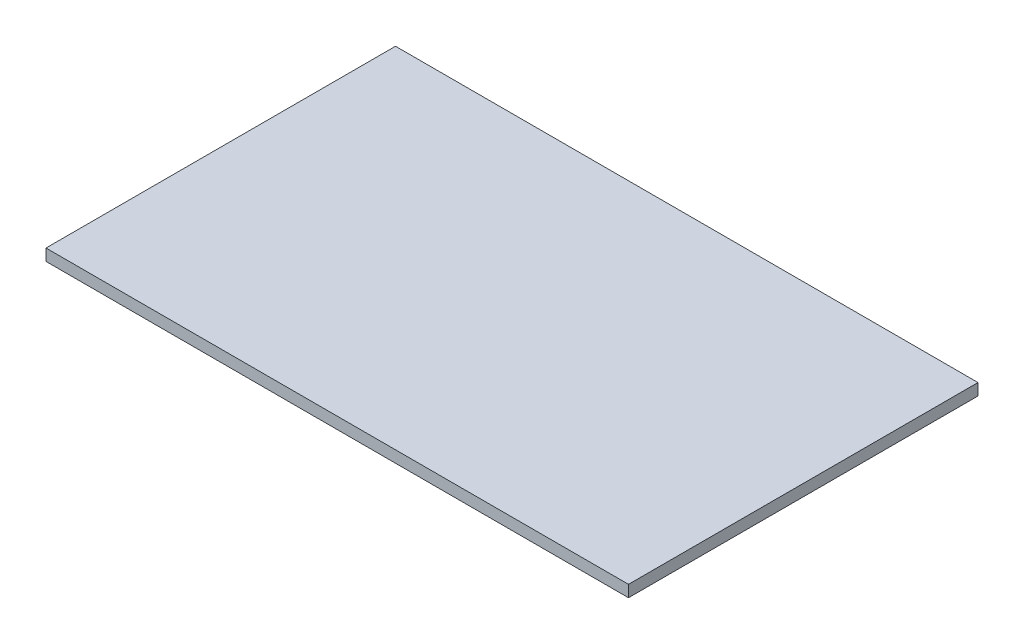
ISO-10303-21;
HEADER;
FILE_DESCRIPTION(('STEP AP214'),'2;1');
FILE_NAME('part.step','',(''),(''),'','','');
FILE_SCHEMA(('AUTOMOTIVE_DESIGN { 1 0 10303 214 1 1 1 1 }'));
ENDSEC;
DATA;
#1=APPLICATION_CONTEXT('core data for automotive mechanical design processes');
#2=APPLICATION_PROTOCOL_DEFINITION('international standard','automotive_design',2000,#1);
#3=PRODUCT_CONTEXT('',#1,'mechanical');
#4=PRODUCT('Part','Part','',(#3));
#5=PRODUCT_RELATED_PRODUCT_CATEGORY('part','',(#4));
#6=PRODUCT_DEFINITION_FORMATION('','',#4);
#7=PRODUCT_DEFINITION_CONTEXT('part definition',#1,'design');
#8=PRODUCT_DEFINITION('design','',#6,#7);
#9=PRODUCT_DEFINITION_SHAPE('','',#8);
#10=(LENGTH_UNIT() NAMED_UNIT(*) SI_UNIT(.MILLI.,.METRE.));
#11=(NAMED_UNIT(*) PLANE_ANGLE_UNIT() SI_UNIT($,.RADIAN.));
#12=(NAMED_UNIT(*) SI_UNIT($,.STERADIAN.) SOLID_ANGLE_UNIT());
#13=UNCERTAINTY_MEASURE_WITH_UNIT(LENGTH_MEASURE(1.E-05),#10,'distance_accuracy_value','');
#14=(GEOMETRIC_REPRESENTATION_CONTEXT(3) GLOBAL_UNCERTAINTY_ASSIGNED_CONTEXT((#13)) GLOBAL_UNIT_ASSIGNED_CONTEXT((#10,
#11,#12)) REPRESENTATION_CONTEXT('',''));
#15=CARTESIAN_POINT('',(0.,0.,0.));
#16=DIRECTION('',(0.,0.,1.));
#17=DIRECTION('',(1.,0.,0.));
#18=AXIS2_PLACEMENT_3D('',#15,#16,#17);
#19=CARTESIAN_POINT('',(0.,5.,0.));
#20=DIRECTION('',(1.,0.,0.));
#21=DIRECTION('',(0.,0.,-1.));
#22=AXIS2_PLACEMENT_3D('',#19,#20,#21);
#23=PLANE('',#22);
#24=DIRECTION('',(0.,0.,1.));
#25=VECTOR('',#24,1.);
#26=CARTESIAN_POINT('',(0.,0.,0.));
#27=LINE('',#26,#25);
#28=CARTESIAN_POINT('',(0.,0.,-150.));
#29=VERTEX_POINT('',#28);
#30=CARTESIAN_POINT('',(0.,0.,0.));
#31=VERTEX_POINT('',#30);
#32=EDGE_CURVE('E95',#29,#31,#27,.T.);
#33=ORIENTED_EDGE('',*,*,#32,.T.);
#34=DIRECTION('',(0.,-1.,0.));
#35=VECTOR('',#34,1.);
#36=CARTESIAN_POINT('',(0.,5.,0.));
#37=LINE('',#36,#35);
#38=CARTESIAN_POINT('',(0.,5.,0.));
#39=VERTEX_POINT('',#38);
#40=EDGE_CURVE('E11',#39,#31,#37,.T.);
#41=ORIENTED_EDGE('',*,*,#40,.F.);
#42=DIRECTION('',(0.,0.,1.));
#43=VECTOR('',#42,1.);
#44=CARTESIAN_POINT('',(0.,5.,0.));
#45=LINE('',#44,#43);
#46=CARTESIAN_POINT('',(0.,5.,-150.));
#47=VERTEX_POINT('',#46);
#48=EDGE_CURVE('E83',#47,#39,#45,.T.);
#49=ORIENTED_EDGE('',*,*,#48,.F.);
#50=DIRECTION('',(0.,-1.,0.));
#51=VECTOR('',#50,1.);
#52=CARTESIAN_POINT('',(0.,5.,-150.));
#53=LINE('',#52,#51);
#54=EDGE_CURVE('E91',#47,#29,#53,.T.);
#55=ORIENTED_EDGE('',*,*,#54,.T.);
#56=EDGE_LOOP('',(#33,#41,#49,#55));
#57=FACE_BOUND('',#56,.T.);
#58=ADVANCED_FACE('F32',(#57),#23,.F.);
#59=CARTESIAN_POINT('',(0.,5.,0.));
#60=DIRECTION('',(0.,0.,-1.));
#61=DIRECTION('',(-1.,0.,0.));
#62=AXIS2_PLACEMENT_3D('',#59,#60,#61);
#63=PLANE('',#62);
#64=DIRECTION('',(1.,0.,0.));
#65=VECTOR('',#64,1.);
#66=CARTESIAN_POINT('',(0.,0.,0.));
#67=LINE('',#66,#65);
#68=CARTESIAN_POINT('',(250.,0.,0.));
#69=VERTEX_POINT('',#68);
#70=EDGE_CURVE('E87',#31,#69,#67,.T.);
#71=ORIENTED_EDGE('',*,*,#70,.T.);
#72=DIRECTION('',(0.,-1.,0.));
#73=VECTOR('',#72,1.);
#74=CARTESIAN_POINT('',(250.,5.,0.));
#75=LINE('',#74,#73);
#76=CARTESIAN_POINT('',(250.,5.,0.));
#77=VERTEX_POINT('',#76);
#78=EDGE_CURVE('E40',#77,#69,#75,.T.);
#79=ORIENTED_EDGE('',*,*,#78,.F.);
#80=DIRECTION('',(1.,0.,0.));
#81=VECTOR('',#80,1.);
#82=CARTESIAN_POINT('',(0.,5.,0.));
#83=LINE('',#82,#81);
#84=EDGE_CURVE('E78',#39,#77,#83,.T.);
#85=ORIENTED_EDGE('',*,*,#84,.F.);
#86=ORIENTED_EDGE('',*,*,#40,.T.);
#87=EDGE_LOOP('',(#71,#79,#85,#86));
#88=FACE_BOUND('',#87,.T.);
#89=ADVANCED_FACE('F86',(#88),#63,.F.);
#90=CARTESIAN_POINT('',(250.,5.,0.));
#91=DIRECTION('',(-1.,0.,0.));
#92=DIRECTION('',(0.,0.,1.));
#93=AXIS2_PLACEMENT_3D('',#90,#91,#92);
#94=PLANE('',#93);
#95=DIRECTION('',(0.,0.,-1.));
#96=VECTOR('',#95,1.);
#97=CARTESIAN_POINT('',(250.,0.,0.));
#98=LINE('',#97,#96);
#99=CARTESIAN_POINT('',(250.,0.,-150.));
#100=VERTEX_POINT('',#99);
#101=EDGE_CURVE('E65',#69,#100,#98,.T.);
#102=ORIENTED_EDGE('',*,*,#101,.T.);
#103=DIRECTION('',(0.,-1.,0.));
#104=VECTOR('',#103,1.);
#105=CARTESIAN_POINT('',(250.,5.,-150.));
#106=LINE('',#105,#104);
#107=CARTESIAN_POINT('',(250.,5.,-150.));
#108=VERTEX_POINT('',#107);
#109=EDGE_CURVE('E88',#108,#100,#106,.T.);
#110=ORIENTED_EDGE('',*,*,#109,.F.);
#111=DIRECTION('',(0.,0.,-1.));
#112=VECTOR('',#111,1.);
#113=CARTESIAN_POINT('',(250.,5.,0.));
#114=LINE('',#113,#112);
#115=EDGE_CURVE('E81',#77,#108,#114,.T.);
#116=ORIENTED_EDGE('',*,*,#115,.F.);
#117=ORIENTED_EDGE('',*,*,#78,.T.);
#118=EDGE_LOOP('',(#102,#110,#116,#117));
#119=FACE_BOUND('',#118,.T.);
#120=ADVANCED_FACE('F89',(#119),#94,.F.);
#121=CARTESIAN_POINT('',(0.,5.,-150.));
#122=DIRECTION('',(0.,0.,1.));
#123=DIRECTION('',(1.,0.,0.));
#124=AXIS2_PLACEMENT_3D('',#121,#122,#123);
#125=PLANE('',#124);
#126=DIRECTION('',(-1.,0.,0.));
#127=VECTOR('',#126,1.);
#128=CARTESIAN_POINT('',(0.,0.,-150.));
#129=LINE('',#128,#127);
#130=EDGE_CURVE('E71',#100,#29,#129,.T.);
#131=ORIENTED_EDGE('',*,*,#130,.T.);
#132=ORIENTED_EDGE('',*,*,#54,.F.);
#133=DIRECTION('',(-1.,0.,0.));
#134=VECTOR('',#133,1.);
#135=CARTESIAN_POINT('',(0.,5.,-150.));
#136=LINE('',#135,#134);
#137=EDGE_CURVE('E48',#108,#47,#136,.T.);
#138=ORIENTED_EDGE('',*,*,#137,.F.);
#139=ORIENTED_EDGE('',*,*,#109,.T.);
#140=EDGE_LOOP('',(#131,#132,#138,#139));
#141=FACE_BOUND('',#140,.T.);
#142=ADVANCED_FACE('F102',(#141),#125,.F.);
#143=CARTESIAN_POINT('',(0.,5.,0.));
#144=DIRECTION('',(0.,-1.,0.));
#145=DIRECTION('',(0.,0.,-1.));
#146=AXIS2_PLACEMENT_3D('',#143,#144,#145);
#147=PLANE('',#146);
#148=ORIENTED_EDGE('',*,*,#48,.T.);
#149=ORIENTED_EDGE('',*,*,#84,.T.);
#150=ORIENTED_EDGE('',*,*,#115,.T.);
#151=ORIENTED_EDGE('',*,*,#137,.T.);
#152=EDGE_LOOP('',(#148,#149,#150,#151));
#153=FACE_BOUND('',#152,.T.);
#154=ADVANCED_FACE('F79',(#153),#147,.F.);
#155=CARTESIAN_POINT('',(0.,0.,0.));
#156=DIRECTION('',(0.,-1.,0.));
#157=DIRECTION('',(0.,0.,-1.));
#158=AXIS2_PLACEMENT_3D('',#155,#156,#157);
#159=PLANE('',#158);
#160=ORIENTED_EDGE('',*,*,#32,.F.);
#161=ORIENTED_EDGE('',*,*,#130,.F.);
#162=ORIENTED_EDGE('',*,*,#101,.F.);
#163=ORIENTED_EDGE('',*,*,#70,.F.);
#164=EDGE_LOOP('',(#160,#161,#162,#163));
#165=FACE_BOUND('',#164,.T.);
#166=ADVANCED_FACE('F105',(#165),#159,.T.);
#167=CLOSED_SHELL('',(#58,#89,#120,#142,#154,#166));
#168=MANIFOLD_SOLID_BREP('B2',#167);
#169=ADVANCED_BREP_SHAPE_REPRESENTATION('',(#18,#168),#14);
#170=SHAPE_DEFINITION_REPRESENTATION(#9,#169);
ENDSEC;
END-ISO-10303-21;
